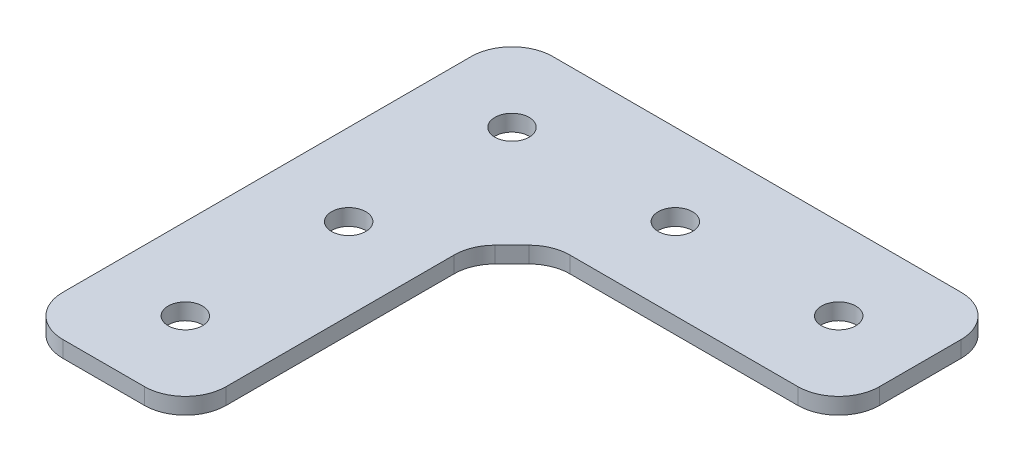
ISO-10303-21;
HEADER;
FILE_DESCRIPTION(('STEP AP214'),'2;1');
FILE_NAME('part.step','',(''),(''),'','','');
FILE_SCHEMA(('AUTOMOTIVE_DESIGN { 1 0 10303 214 1 1 1 1 }'));
ENDSEC;
DATA;
#1=APPLICATION_CONTEXT('core data for automotive mechanical design processes');
#2=APPLICATION_PROTOCOL_DEFINITION('international standard','automotive_design',2000,#1);
#3=PRODUCT_CONTEXT('',#1,'mechanical');
#4=PRODUCT('Part','Part','',(#3));
#5=PRODUCT_RELATED_PRODUCT_CATEGORY('part','',(#4));
#6=PRODUCT_DEFINITION_FORMATION('','',#4);
#7=PRODUCT_DEFINITION_CONTEXT('part definition',#1,'design');
#8=PRODUCT_DEFINITION('design','',#6,#7);
#9=PRODUCT_DEFINITION_SHAPE('','',#8);
#10=(LENGTH_UNIT() NAMED_UNIT(*) SI_UNIT(.MILLI.,.METRE.));
#11=(NAMED_UNIT(*) PLANE_ANGLE_UNIT() SI_UNIT($,.RADIAN.));
#12=(NAMED_UNIT(*) SI_UNIT($,.STERADIAN.) SOLID_ANGLE_UNIT());
#13=UNCERTAINTY_MEASURE_WITH_UNIT(LENGTH_MEASURE(1.E-05),#10,'distance_accuracy_value','');
#14=(GEOMETRIC_REPRESENTATION_CONTEXT(3) GLOBAL_UNCERTAINTY_ASSIGNED_CONTEXT((#13)) GLOBAL_UNIT_ASSIGNED_CONTEXT((#10,
#11,#12)) REPRESENTATION_CONTEXT('',''));
#15=CARTESIAN_POINT('',(0.,0.,0.));
#16=DIRECTION('',(0.,0.,1.));
#17=DIRECTION('',(1.,0.,0.));
#18=AXIS2_PLACEMENT_3D('',#15,#16,#17);
#19=CARTESIAN_POINT('',(10.0000000000002,-2.,10.));
#20=DIRECTION('',(1.,0.,0.));
#21=DIRECTION('',(0.,0.,-1.));
#22=AXIS2_PLACEMENT_3D('',#19,#20,#21);
#23=PLANE('',#22);
#24=DIRECTION('',(0.,0.,-1.));
#25=VECTOR('',#24,1.);
#26=CARTESIAN_POINT('',(10.0000000000002,-2.,10.));
#27=LINE('',#26,#25);
#28=CARTESIAN_POINT('',(10.0000000000002,-2.,45.));
#29=VERTEX_POINT('',#28);
#30=CARTESIAN_POINT('',(10.0000000000002,-2.,17.0710678118655));
#31=VERTEX_POINT('',#30);
#32=EDGE_CURVE('E262',#29,#31,#27,.T.);
#33=ORIENTED_EDGE('',*,*,#32,.T.);
#34=DIRECTION('',(0.,-1.,0.));
#35=VECTOR('',#34,1.);
#36=CARTESIAN_POINT('',(10.0000000000002,-2.,17.0710678118655));
#37=LINE('',#36,#35);
#38=CARTESIAN_POINT('',(10.0000000000002,0.,17.0710678118655));
#39=VERTEX_POINT('',#38);
#40=EDGE_CURVE('E216',#31,#39,#37,.F.);
#41=ORIENTED_EDGE('',*,*,#40,.T.);
#42=DIRECTION('',(0.,0.,-1.));
#43=VECTOR('',#42,1.);
#44=CARTESIAN_POINT('',(10.0000000000002,0.,10.));
#45=LINE('',#44,#43);
#46=CARTESIAN_POINT('',(10.0000000000002,0.,45.));
#47=VERTEX_POINT('',#46);
#48=EDGE_CURVE('E245',#47,#39,#45,.T.);
#49=ORIENTED_EDGE('',*,*,#48,.F.);
#50=DIRECTION('',(0.,1.,0.));
#51=VECTOR('',#50,1.);
#52=CARTESIAN_POINT('',(10.0000000000002,-2.,45.));
#53=LINE('',#52,#51);
#54=EDGE_CURVE('E197',#47,#29,#53,.F.);
#55=ORIENTED_EDGE('',*,*,#54,.T.);
#56=EDGE_LOOP('',(#33,#41,#49,#55));
#57=FACE_BOUND('',#56,.T.);
#58=ADVANCED_FACE('F43',(#57),#23,.T.);
#59=CARTESIAN_POINT('',(-9.99999999999979,-2.,50.));
#60=DIRECTION('',(0.,0.,1.));
#61=DIRECTION('',(1.,0.,0.));
#62=AXIS2_PLACEMENT_3D('',#59,#60,#61);
#63=PLANE('',#62);
#64=DIRECTION('',(1.,0.,0.));
#65=VECTOR('',#64,1.);
#66=CARTESIAN_POINT('',(-9.99999999999979,0.,50.));
#67=LINE('',#66,#65);
#68=CARTESIAN_POINT('',(-4.99999999999979,0.,50.));
#69=VERTEX_POINT('',#68);
#70=CARTESIAN_POINT('',(5.00000000000021,0.,50.));
#71=VERTEX_POINT('',#70);
#72=EDGE_CURVE('E162',#69,#71,#67,.T.);
#73=ORIENTED_EDGE('',*,*,#72,.F.);
#74=DIRECTION('',(0.,1.,0.));
#75=VECTOR('',#74,1.);
#76=CARTESIAN_POINT('',(-4.99999999999979,-2.,50.));
#77=LINE('',#76,#75);
#78=CARTESIAN_POINT('',(-4.99999999999979,-2.,50.));
#79=VERTEX_POINT('',#78);
#80=EDGE_CURVE('E185',#69,#79,#77,.F.);
#81=ORIENTED_EDGE('',*,*,#80,.T.);
#82=DIRECTION('',(1.,0.,0.));
#83=VECTOR('',#82,1.);
#84=CARTESIAN_POINT('',(-9.99999999999979,-2.,50.));
#85=LINE('',#84,#83);
#86=CARTESIAN_POINT('',(5.00000000000021,-2.,50.));
#87=VERTEX_POINT('',#86);
#88=EDGE_CURVE('E167',#79,#87,#85,.T.);
#89=ORIENTED_EDGE('',*,*,#88,.T.);
#90=DIRECTION('',(0.,1.,0.));
#91=VECTOR('',#90,1.);
#92=CARTESIAN_POINT('',(5.00000000000021,-2.,50.));
#93=LINE('',#92,#91);
#94=EDGE_CURVE('E182',#87,#71,#93,.T.);
#95=ORIENTED_EDGE('',*,*,#94,.T.);
#96=EDGE_LOOP('',(#73,#81,#89,#95));
#97=FACE_BOUND('',#96,.T.);
#98=ADVANCED_FACE('F330',(#97),#63,.T.);
#99=CARTESIAN_POINT('',(-9.9999999999998,-2.,-9.99999999999999));
#100=DIRECTION('',(-1.,0.,0.));
#101=DIRECTION('',(0.,0.,1.));
#102=AXIS2_PLACEMENT_3D('',#99,#100,#101);
#103=PLANE('',#102);
#104=DIRECTION('',(0.,0.,1.));
#105=VECTOR('',#104,1.);
#106=CARTESIAN_POINT('',(-9.9999999999998,-2.,-9.99999999999999));
#107=LINE('',#106,#105);
#108=CARTESIAN_POINT('',(-9.9999999999998,-2.,-4.99999999999999));
#109=VERTEX_POINT('',#108);
#110=CARTESIAN_POINT('',(-9.99999999999979,-2.,45.));
#111=VERTEX_POINT('',#110);
#112=EDGE_CURVE('E171',#109,#111,#107,.T.);
#113=ORIENTED_EDGE('',*,*,#112,.T.);
#114=DIRECTION('',(0.,1.,0.));
#115=VECTOR('',#114,1.);
#116=CARTESIAN_POINT('',(-9.99999999999979,-2.,45.));
#117=LINE('',#116,#115);
#118=CARTESIAN_POINT('',(-9.99999999999979,0.,45.));
#119=VERTEX_POINT('',#118);
#120=EDGE_CURVE('E153',#111,#119,#117,.T.);
#121=ORIENTED_EDGE('',*,*,#120,.T.);
#122=DIRECTION('',(0.,0.,1.));
#123=VECTOR('',#122,1.);
#124=CARTESIAN_POINT('',(-9.9999999999998,0.,-9.99999999999999));
#125=LINE('',#124,#123);
#126=CARTESIAN_POINT('',(-9.9999999999998,0.,-4.99999999999999));
#127=VERTEX_POINT('',#126);
#128=EDGE_CURVE('E145',#127,#119,#125,.T.);
#129=ORIENTED_EDGE('',*,*,#128,.F.);
#130=DIRECTION('',(0.,1.,0.));
#131=VECTOR('',#130,1.);
#132=CARTESIAN_POINT('',(-9.9999999999998,-2.,-4.99999999999999));
#133=LINE('',#132,#131);
#134=EDGE_CURVE('E159',#127,#109,#133,.F.);
#135=ORIENTED_EDGE('',*,*,#134,.T.);
#136=EDGE_LOOP('',(#113,#121,#129,#135));
#137=FACE_BOUND('',#136,.T.);
#138=ADVANCED_FACE('F158',(#137),#103,.T.);
#139=CARTESIAN_POINT('',(-9.9999999999998,-2.,-9.99999999999999));
#140=DIRECTION('',(0.,0.,-1.));
#141=DIRECTION('',(-1.,0.,0.));
#142=AXIS2_PLACEMENT_3D('',#139,#140,#141);
#143=PLANE('',#142);
#144=DIRECTION('',(-1.,0.,0.));
#145=VECTOR('',#144,1.);
#146=CARTESIAN_POINT('',(-9.9999999999998,0.,-9.99999999999999));
#147=LINE('',#146,#145);
#148=CARTESIAN_POINT('',(45.0000000000002,0.,-9.99999999999999));
#149=VERTEX_POINT('',#148);
#150=CARTESIAN_POINT('',(-4.9999999999998,0.,-9.99999999999999));
#151=VERTEX_POINT('',#150);
#152=EDGE_CURVE('E147',#149,#151,#147,.T.);
#153=ORIENTED_EDGE('',*,*,#152,.F.);
#154=DIRECTION('',(0.,1.,0.));
#155=VECTOR('',#154,1.);
#156=CARTESIAN_POINT('',(45.0000000000002,-2.,-9.99999999999999));
#157=LINE('',#156,#155);
#158=CARTESIAN_POINT('',(45.0000000000002,-2.,-9.99999999999999));
#159=VERTEX_POINT('',#158);
#160=EDGE_CURVE('E209',#149,#159,#157,.F.);
#161=ORIENTED_EDGE('',*,*,#160,.T.);
#162=DIRECTION('',(-1.,0.,0.));
#163=VECTOR('',#162,1.);
#164=CARTESIAN_POINT('',(-9.9999999999998,-2.,-9.99999999999999));
#165=LINE('',#164,#163);
#166=CARTESIAN_POINT('',(-4.9999999999998,-2.,-9.99999999999999));
#167=VERTEX_POINT('',#166);
#168=EDGE_CURVE('E255',#159,#167,#165,.T.);
#169=ORIENTED_EDGE('',*,*,#168,.T.);
#170=DIRECTION('',(0.,1.,0.));
#171=VECTOR('',#170,1.);
#172=CARTESIAN_POINT('',(-4.9999999999998,-2.,-9.99999999999999));
#173=LINE('',#172,#171);
#174=EDGE_CURVE('E207',#167,#151,#173,.T.);
#175=ORIENTED_EDGE('',*,*,#174,.T.);
#176=EDGE_LOOP('',(#153,#161,#169,#175));
#177=FACE_BOUND('',#176,.T.);
#178=ADVANCED_FACE('F381',(#177),#143,.T.);
#179=CARTESIAN_POINT('',(50.0000000000002,-2.,-9.99999999999999));
#180=DIRECTION('',(1.,0.,0.));
#181=DIRECTION('',(0.,0.,-1.));
#182=AXIS2_PLACEMENT_3D('',#179,#180,#181);
#183=PLANE('',#182);
#184=DIRECTION('',(0.,0.,-1.));
#185=VECTOR('',#184,1.);
#186=CARTESIAN_POINT('',(50.0000000000002,0.,-9.99999999999999));
#187=LINE('',#186,#185);
#188=CARTESIAN_POINT('',(50.0000000000002,0.,5.00000000000001));
#189=VERTEX_POINT('',#188);
#190=CARTESIAN_POINT('',(50.0000000000002,0.,-4.99999999999999));
#191=VERTEX_POINT('',#190);
#192=EDGE_CURVE('E244',#189,#191,#187,.T.);
#193=ORIENTED_EDGE('',*,*,#192,.F.);
#194=DIRECTION('',(0.,1.,0.));
#195=VECTOR('',#194,1.);
#196=CARTESIAN_POINT('',(50.0000000000002,-2.,5.00000000000001));
#197=LINE('',#196,#195);
#198=CARTESIAN_POINT('',(50.0000000000002,-2.,5.00000000000001));
#199=VERTEX_POINT('',#198);
#200=EDGE_CURVE('E205',#189,#199,#197,.F.);
#201=ORIENTED_EDGE('',*,*,#200,.T.);
#202=DIRECTION('',(0.,0.,-1.));
#203=VECTOR('',#202,1.);
#204=CARTESIAN_POINT('',(50.0000000000002,-2.,-9.99999999999999));
#205=LINE('',#204,#203);
#206=CARTESIAN_POINT('',(50.0000000000002,-2.,-4.99999999999999));
#207=VERTEX_POINT('',#206);
#208=EDGE_CURVE('E258',#199,#207,#205,.T.);
#209=ORIENTED_EDGE('',*,*,#208,.T.);
#210=DIRECTION('',(0.,1.,0.));
#211=VECTOR('',#210,1.);
#212=CARTESIAN_POINT('',(50.0000000000002,-2.,-4.99999999999999));
#213=LINE('',#212,#211);
#214=EDGE_CURVE('E202',#207,#191,#213,.T.);
#215=ORIENTED_EDGE('',*,*,#214,.T.);
#216=EDGE_LOOP('',(#193,#201,#209,#215));
#217=FACE_BOUND('',#216,.T.);
#218=ADVANCED_FACE('F388',(#217),#183,.T.);
#219=CARTESIAN_POINT('',(50.0000000000002,-2.,10.));
#220=DIRECTION('',(0.,0.,1.));
#221=DIRECTION('',(1.,0.,0.));
#222=AXIS2_PLACEMENT_3D('',#219,#220,#221);
#223=PLANE('',#222);
#224=DIRECTION('',(1.,0.,0.));
#225=VECTOR('',#224,1.);
#226=CARTESIAN_POINT('',(50.0000000000002,0.,10.));
#227=LINE('',#226,#225);
#228=CARTESIAN_POINT('',(17.0710678118657,0.,10.));
#229=VERTEX_POINT('',#228);
#230=CARTESIAN_POINT('',(45.0000000000002,0.,10.));
#231=VERTEX_POINT('',#230);
#232=EDGE_CURVE('E241',#229,#231,#227,.T.);
#233=ORIENTED_EDGE('',*,*,#232,.F.);
#234=DIRECTION('',(0.,1.,0.));
#235=VECTOR('',#234,1.);
#236=CARTESIAN_POINT('',(17.0710678118657,-2.,10.));
#237=LINE('',#236,#235);
#238=CARTESIAN_POINT('',(17.0710678118657,-2.,10.));
#239=VERTEX_POINT('',#238);
#240=EDGE_CURVE('E223',#229,#239,#237,.F.);
#241=ORIENTED_EDGE('',*,*,#240,.T.);
#242=DIRECTION('',(1.,0.,0.));
#243=VECTOR('',#242,1.);
#244=CARTESIAN_POINT('',(50.0000000000002,-2.,10.));
#245=LINE('',#244,#243);
#246=CARTESIAN_POINT('',(45.0000000000002,-2.,10.));
#247=VERTEX_POINT('',#246);
#248=EDGE_CURVE('E234',#239,#247,#245,.T.);
#249=ORIENTED_EDGE('',*,*,#248,.T.);
#250=DIRECTION('',(0.,1.,0.));
#251=VECTOR('',#250,1.);
#252=CARTESIAN_POINT('',(45.0000000000002,-2.,10.));
#253=LINE('',#252,#251);
#254=EDGE_CURVE('E199',#247,#231,#253,.T.);
#255=ORIENTED_EDGE('',*,*,#254,.T.);
#256=EDGE_LOOP('',(#233,#241,#249,#255));
#257=FACE_BOUND('',#256,.T.);
#258=ADVANCED_FACE('F240',(#257),#223,.T.);
#259=CARTESIAN_POINT('',(0.,-2.,0.));
#260=DIRECTION('',(0.,1.,0.));
#261=DIRECTION('',(0.,0.,1.));
#262=AXIS2_PLACEMENT_3D('',#259,#260,#261);
#263=PLANE('',#262);
#264=CARTESIAN_POINT('',(4.16528467062881E-13,-2.,40.));
#265=DIRECTION('',(0.,1.,0.));
#266=DIRECTION('',(0.,0.,1.));
#267=AXIS2_PLACEMENT_3D('',#264,#265,#266);
#268=CIRCLE('',#267,2.1);
#269=CARTESIAN_POINT('',(4.16528467062881E-13,-2.,42.1));
#270=VERTEX_POINT('',#269);
#271=EDGE_CURVE('E286',#270,#270,#268,.T.);
#272=ORIENTED_EDGE('',*,*,#271,.T.);
#273=EDGE_LOOP('',(#272));
#274=FACE_BOUND('',#273,.T.);
#275=CARTESIAN_POINT('',(2.08264233531441E-13,-2.,20.));
#276=DIRECTION('',(0.,1.,0.));
#277=DIRECTION('',(0.,0.,1.));
#278=AXIS2_PLACEMENT_3D('',#275,#276,#277);
#279=CIRCLE('',#278,2.1);
#280=CARTESIAN_POINT('',(2.08264233531441E-13,-2.,22.1));
#281=VERTEX_POINT('',#280);
#282=EDGE_CURVE('E280',#281,#281,#279,.T.);
#283=ORIENTED_EDGE('',*,*,#282,.T.);
#284=EDGE_LOOP('',(#283));
#285=FACE_BOUND('',#284,.T.);
#286=CARTESIAN_POINT('',(40.,-2.,0.));
#287=DIRECTION('',(0.,1.,0.));
#288=DIRECTION('',(0.,0.,1.));
#289=AXIS2_PLACEMENT_3D('',#286,#287,#288);
#290=CIRCLE('',#289,2.1);
#291=CARTESIAN_POINT('',(40.,-2.,2.1));
#292=VERTEX_POINT('',#291);
#293=EDGE_CURVE('E274',#292,#292,#290,.T.);
#294=ORIENTED_EDGE('',*,*,#293,.T.);
#295=EDGE_LOOP('',(#294));
#296=FACE_BOUND('',#295,.T.);
#297=CARTESIAN_POINT('',(20.,-2.,0.));
#298=DIRECTION('',(0.,1.,0.));
#299=DIRECTION('',(0.,0.,1.));
#300=AXIS2_PLACEMENT_3D('',#297,#298,#299);
#301=CIRCLE('',#300,2.1);
#302=CARTESIAN_POINT('',(20.,-2.,2.1));
#303=VERTEX_POINT('',#302);
#304=EDGE_CURVE('E268',#303,#303,#301,.T.);
#305=ORIENTED_EDGE('',*,*,#304,.T.);
#306=EDGE_LOOP('',(#305));
#307=FACE_BOUND('',#306,.T.);
#308=CARTESIAN_POINT('',(0.,-2.,0.));
#309=DIRECTION('',(0.,1.,0.));
#310=DIRECTION('',(0.,0.,1.));
#311=AXIS2_PLACEMENT_3D('',#308,#309,#310);
#312=CIRCLE('',#311,2.1);
#313=CARTESIAN_POINT('',(0.,-2.,2.1));
#314=VERTEX_POINT('',#313);
#315=EDGE_CURVE('E250',#314,#314,#312,.T.);
#316=ORIENTED_EDGE('',*,*,#315,.T.);
#317=EDGE_LOOP('',(#316));
#318=FACE_BOUND('',#317,.T.);
#319=ORIENTED_EDGE('',*,*,#88,.F.);
#320=CARTESIAN_POINT('',(-4.99999999999979,-2.,45.));
#321=DIRECTION('',(0.,1.,0.));
#322=DIRECTION('',(0.,0.,1.));
#323=AXIS2_PLACEMENT_3D('',#320,#321,#322);
#324=CIRCLE('',#323,5.);
#325=EDGE_CURVE('E195',#79,#111,#324,.F.);
#326=ORIENTED_EDGE('',*,*,#325,.T.);
#327=ORIENTED_EDGE('',*,*,#112,.F.);
#328=CARTESIAN_POINT('',(-4.9999999999998,-2.,-4.99999999999999));
#329=DIRECTION('',(0.,1.,0.));
#330=DIRECTION('',(0.,0.,1.));
#331=AXIS2_PLACEMENT_3D('',#328,#329,#330);
#332=CIRCLE('',#331,5.);
#333=EDGE_CURVE('E166',#109,#167,#332,.F.);
#334=ORIENTED_EDGE('',*,*,#333,.T.);
#335=ORIENTED_EDGE('',*,*,#168,.F.);
#336=CARTESIAN_POINT('',(45.0000000000002,-2.,-4.99999999999999));
#337=DIRECTION('',(0.,1.,0.));
#338=DIRECTION('',(0.,0.,1.));
#339=AXIS2_PLACEMENT_3D('',#336,#337,#338);
#340=CIRCLE('',#339,5.);
#341=EDGE_CURVE('E188',#159,#207,#340,.F.);
#342=ORIENTED_EDGE('',*,*,#341,.T.);
#343=ORIENTED_EDGE('',*,*,#208,.F.);
#344=CARTESIAN_POINT('',(45.0000000000002,-2.,5.00000000000001));
#345=DIRECTION('',(0.,1.,0.));
#346=DIRECTION('',(0.,0.,1.));
#347=AXIS2_PLACEMENT_3D('',#344,#345,#346);
#348=CIRCLE('',#347,5.);
#349=EDGE_CURVE('E190',#199,#247,#348,.F.);
#350=ORIENTED_EDGE('',*,*,#349,.T.);
#351=ORIENTED_EDGE('',*,*,#248,.F.);
#352=CARTESIAN_POINT('',(17.0710678118657,-2.,15.));
#353=DIRECTION('',(0.,1.,0.));
#354=DIRECTION('',(0.,0.,1.));
#355=AXIS2_PLACEMENT_3D('',#352,#353,#354);
#356=CIRCLE('',#355,5.);
#357=CARTESIAN_POINT('',(13.5355339059329,-2.,11.4644660940673));
#358=VERTEX_POINT('',#357);
#359=EDGE_CURVE('E51',#239,#358,#356,.T.);
#360=ORIENTED_EDGE('',*,*,#359,.T.);
#361=DIRECTION('',(0.707106781186544,0.,-0.707106781186551));
#362=VECTOR('',#361,1.);
#363=CARTESIAN_POINT('',(12.5000000000002,-2.,12.5000000000001));
#364=LINE('',#363,#362);
#365=CARTESIAN_POINT('',(11.4644660940674,-2.,13.5355339059328));
#366=VERTEX_POINT('',#365);
#367=EDGE_CURVE('E213',#358,#366,#364,.F.);
#368=ORIENTED_EDGE('',*,*,#367,.T.);
#369=CARTESIAN_POINT('',(15.0000000000002,-2.,17.0710678118655));
#370=DIRECTION('',(0.,1.,0.));
#371=DIRECTION('',(0.,0.,1.));
#372=AXIS2_PLACEMENT_3D('',#369,#370,#371);
#373=CIRCLE('',#372,5.);
#374=EDGE_CURVE('E227',#366,#31,#373,.T.);
#375=ORIENTED_EDGE('',*,*,#374,.T.);
#376=ORIENTED_EDGE('',*,*,#32,.F.);
#377=CARTESIAN_POINT('',(5.00000000000021,-2.,45.));
#378=DIRECTION('',(0.,1.,0.));
#379=DIRECTION('',(0.,0.,1.));
#380=AXIS2_PLACEMENT_3D('',#377,#378,#379);
#381=CIRCLE('',#380,5.);
#382=EDGE_CURVE('E193',#29,#87,#381,.F.);
#383=ORIENTED_EDGE('',*,*,#382,.T.);
#384=EDGE_LOOP('',(#319,#326,#327,#334,#335,#342,#343,#350,#351,#360,#368,#375,#376,#383));
#385=FACE_BOUND('',#384,.T.);
#386=ADVANCED_FACE('F232',(#274,#285,#296,#307,#318,#385),#263,.F.);
#387=CARTESIAN_POINT('',(0.,0.,0.));
#388=DIRECTION('',(0.,1.,0.));
#389=DIRECTION('',(0.,0.,1.));
#390=AXIS2_PLACEMENT_3D('',#387,#388,#389);
#391=PLANE('',#390);
#392=CARTESIAN_POINT('',(4.16528467062881E-13,0.,40.));
#393=DIRECTION('',(0.,1.,0.));
#394=DIRECTION('',(0.,0.,1.));
#395=AXIS2_PLACEMENT_3D('',#392,#393,#394);
#396=CIRCLE('',#395,2.1);
#397=CARTESIAN_POINT('',(4.16528467062881E-13,0.,42.1));
#398=VERTEX_POINT('',#397);
#399=EDGE_CURVE('E289',#398,#398,#396,.T.);
#400=ORIENTED_EDGE('',*,*,#399,.F.);
#401=EDGE_LOOP('',(#400));
#402=FACE_BOUND('',#401,.T.);
#403=CARTESIAN_POINT('',(2.08264233531441E-13,0.,20.));
#404=DIRECTION('',(0.,1.,0.));
#405=DIRECTION('',(0.,0.,1.));
#406=AXIS2_PLACEMENT_3D('',#403,#404,#405);
#407=CIRCLE('',#406,2.1);
#408=CARTESIAN_POINT('',(2.08264233531441E-13,0.,22.1));
#409=VERTEX_POINT('',#408);
#410=EDGE_CURVE('E283',#409,#409,#407,.T.);
#411=ORIENTED_EDGE('',*,*,#410,.F.);
#412=EDGE_LOOP('',(#411));
#413=FACE_BOUND('',#412,.T.);
#414=CARTESIAN_POINT('',(40.,0.,0.));
#415=DIRECTION('',(0.,1.,0.));
#416=DIRECTION('',(0.,0.,1.));
#417=AXIS2_PLACEMENT_3D('',#414,#415,#416);
#418=CIRCLE('',#417,2.1);
#419=CARTESIAN_POINT('',(40.,0.,2.1));
#420=VERTEX_POINT('',#419);
#421=EDGE_CURVE('E277',#420,#420,#418,.T.);
#422=ORIENTED_EDGE('',*,*,#421,.F.);
#423=EDGE_LOOP('',(#422));
#424=FACE_BOUND('',#423,.T.);
#425=CARTESIAN_POINT('',(20.,0.,0.));
#426=DIRECTION('',(0.,1.,0.));
#427=DIRECTION('',(0.,0.,1.));
#428=AXIS2_PLACEMENT_3D('',#425,#426,#427);
#429=CIRCLE('',#428,2.1);
#430=CARTESIAN_POINT('',(20.,0.,2.1));
#431=VERTEX_POINT('',#430);
#432=EDGE_CURVE('E271',#431,#431,#429,.T.);
#433=ORIENTED_EDGE('',*,*,#432,.F.);
#434=EDGE_LOOP('',(#433));
#435=FACE_BOUND('',#434,.T.);
#436=CARTESIAN_POINT('',(0.,0.,0.));
#437=DIRECTION('',(0.,1.,0.));
#438=DIRECTION('',(0.,0.,1.));
#439=AXIS2_PLACEMENT_3D('',#436,#437,#438);
#440=CIRCLE('',#439,2.1);
#441=CARTESIAN_POINT('',(0.,0.,2.1));
#442=VERTEX_POINT('',#441);
#443=EDGE_CURVE('E265',#442,#442,#440,.T.);
#444=ORIENTED_EDGE('',*,*,#443,.F.);
#445=EDGE_LOOP('',(#444));
#446=FACE_BOUND('',#445,.T.);
#447=ORIENTED_EDGE('',*,*,#128,.T.);
#448=CARTESIAN_POINT('',(-4.99999999999979,0.,45.));
#449=DIRECTION('',(0.,1.,0.));
#450=DIRECTION('',(0.,0.,1.));
#451=AXIS2_PLACEMENT_3D('',#448,#449,#450);
#452=CIRCLE('',#451,5.);
#453=EDGE_CURVE('E180',#119,#69,#452,.T.);
#454=ORIENTED_EDGE('',*,*,#453,.T.);
#455=ORIENTED_EDGE('',*,*,#72,.T.);
#456=CARTESIAN_POINT('',(5.00000000000021,0.,45.));
#457=DIRECTION('',(0.,1.,0.));
#458=DIRECTION('',(0.,0.,1.));
#459=AXIS2_PLACEMENT_3D('',#456,#457,#458);
#460=CIRCLE('',#459,5.);
#461=EDGE_CURVE('E178',#71,#47,#460,.T.);
#462=ORIENTED_EDGE('',*,*,#461,.T.);
#463=ORIENTED_EDGE('',*,*,#48,.T.);
#464=CARTESIAN_POINT('',(15.0000000000002,0.,17.0710678118655));
#465=DIRECTION('',(0.,1.,0.));
#466=DIRECTION('',(0.,0.,1.));
#467=AXIS2_PLACEMENT_3D('',#464,#465,#466);
#468=CIRCLE('',#467,5.);
#469=CARTESIAN_POINT('',(11.4644660940674,0.,13.5355339059328));
#470=VERTEX_POINT('',#469);
#471=EDGE_CURVE('E225',#39,#470,#468,.F.);
#472=ORIENTED_EDGE('',*,*,#471,.T.);
#473=DIRECTION('',(-0.707106781186544,0.,0.707106781186551));
#474=VECTOR('',#473,1.);
#475=CARTESIAN_POINT('',(10.0000000000002,0.,15.));
#476=LINE('',#475,#474);
#477=CARTESIAN_POINT('',(13.5355339059329,0.,11.4644660940673));
#478=VERTEX_POINT('',#477);
#479=EDGE_CURVE('E211',#470,#478,#476,.F.);
#480=ORIENTED_EDGE('',*,*,#479,.T.);
#481=CARTESIAN_POINT('',(17.0710678118657,0.,15.));
#482=DIRECTION('',(0.,1.,0.));
#483=DIRECTION('',(0.,0.,1.));
#484=AXIS2_PLACEMENT_3D('',#481,#482,#483);
#485=CIRCLE('',#484,5.);
#486=EDGE_CURVE('E11',#478,#229,#485,.F.);
#487=ORIENTED_EDGE('',*,*,#486,.T.);
#488=ORIENTED_EDGE('',*,*,#232,.T.);
#489=CARTESIAN_POINT('',(45.0000000000002,0.,5.00000000000001));
#490=DIRECTION('',(0.,1.,0.));
#491=DIRECTION('',(0.,0.,1.));
#492=AXIS2_PLACEMENT_3D('',#489,#490,#491);
#493=CIRCLE('',#492,5.);
#494=EDGE_CURVE('E176',#231,#189,#493,.T.);
#495=ORIENTED_EDGE('',*,*,#494,.T.);
#496=ORIENTED_EDGE('',*,*,#192,.T.);
#497=CARTESIAN_POINT('',(45.0000000000002,0.,-4.99999999999999));
#498=DIRECTION('',(0.,1.,0.));
#499=DIRECTION('',(0.,0.,1.));
#500=AXIS2_PLACEMENT_3D('',#497,#498,#499);
#501=CIRCLE('',#500,5.);
#502=EDGE_CURVE('E152',#191,#149,#501,.T.);
#503=ORIENTED_EDGE('',*,*,#502,.T.);
#504=ORIENTED_EDGE('',*,*,#152,.T.);
#505=CARTESIAN_POINT('',(-4.9999999999998,0.,-4.99999999999999));
#506=DIRECTION('',(0.,1.,0.));
#507=DIRECTION('',(0.,0.,1.));
#508=AXIS2_PLACEMENT_3D('',#505,#506,#507);
#509=CIRCLE('',#508,5.);
#510=EDGE_CURVE('E142',#151,#127,#509,.T.);
#511=ORIENTED_EDGE('',*,*,#510,.T.);
#512=EDGE_LOOP('',(#447,#454,#455,#462,#463,#472,#480,#487,#488,#495,#496,#503,#504,#511));
#513=FACE_BOUND('',#512,.T.);
#514=ADVANCED_FACE('F144',(#402,#413,#424,#435,#446,#513),#391,.T.);
#515=CARTESIAN_POINT('',(0.,-2.,0.));
#516=DIRECTION('',(0.,1.,0.));
#517=DIRECTION('',(0.,0.,1.));
#518=AXIS2_PLACEMENT_3D('',#515,#516,#517);
#519=CYLINDRICAL_SURFACE('',#518,2.1);
#520=ORIENTED_EDGE('',*,*,#315,.F.);
#521=EDGE_LOOP('',(#520));
#522=FACE_BOUND('',#521,.T.);
#523=ORIENTED_EDGE('',*,*,#443,.T.);
#524=EDGE_LOOP('',(#523));
#525=FACE_BOUND('',#524,.T.);
#526=ADVANCED_FACE('F307',(#522,#525),#519,.F.);
#527=CARTESIAN_POINT('',(20.,-2.,0.));
#528=DIRECTION('',(0.,1.,0.));
#529=DIRECTION('',(0.,0.,1.));
#530=AXIS2_PLACEMENT_3D('',#527,#528,#529);
#531=CYLINDRICAL_SURFACE('',#530,2.1);
#532=ORIENTED_EDGE('',*,*,#304,.F.);
#533=EDGE_LOOP('',(#532));
#534=FACE_BOUND('',#533,.T.);
#535=ORIENTED_EDGE('',*,*,#432,.T.);
#536=EDGE_LOOP('',(#535));
#537=FACE_BOUND('',#536,.T.);
#538=ADVANCED_FACE('F318',(#534,#537),#531,.F.);
#539=CARTESIAN_POINT('',(40.,-2.,0.));
#540=DIRECTION('',(0.,1.,0.));
#541=DIRECTION('',(0.,0.,1.));
#542=AXIS2_PLACEMENT_3D('',#539,#540,#541);
#543=CYLINDRICAL_SURFACE('',#542,2.1);
#544=ORIENTED_EDGE('',*,*,#293,.F.);
#545=EDGE_LOOP('',(#544));
#546=FACE_BOUND('',#545,.T.);
#547=ORIENTED_EDGE('',*,*,#421,.T.);
#548=EDGE_LOOP('',(#547));
#549=FACE_BOUND('',#548,.T.);
#550=ADVANCED_FACE('F324',(#546,#549),#543,.F.);
#551=CARTESIAN_POINT('',(2.08264233531441E-13,-2.,20.));
#552=DIRECTION('',(0.,1.,0.));
#553=DIRECTION('',(0.,0.,1.));
#554=AXIS2_PLACEMENT_3D('',#551,#552,#553);
#555=CYLINDRICAL_SURFACE('',#554,2.1);
#556=ORIENTED_EDGE('',*,*,#282,.F.);
#557=EDGE_LOOP('',(#556));
#558=FACE_BOUND('',#557,.T.);
#559=ORIENTED_EDGE('',*,*,#410,.T.);
#560=EDGE_LOOP('',(#559));
#561=FACE_BOUND('',#560,.T.);
#562=ADVANCED_FACE('F301',(#558,#561),#555,.F.);
#563=CARTESIAN_POINT('',(4.16528467062881E-13,-2.,40.));
#564=DIRECTION('',(0.,1.,0.));
#565=DIRECTION('',(0.,0.,1.));
#566=AXIS2_PLACEMENT_3D('',#563,#564,#565);
#567=CYLINDRICAL_SURFACE('',#566,2.1);
#568=ORIENTED_EDGE('',*,*,#271,.F.);
#569=EDGE_LOOP('',(#568));
#570=FACE_BOUND('',#569,.T.);
#571=ORIENTED_EDGE('',*,*,#399,.T.);
#572=EDGE_LOOP('',(#571));
#573=FACE_BOUND('',#572,.T.);
#574=ADVANCED_FACE('F297',(#570,#573),#567,.F.);
#575=CARTESIAN_POINT('',(-4.99999999999979,-2.,45.));
#576=DIRECTION('',(0.,1.,0.));
#577=DIRECTION('',(0.,0.,1.));
#578=AXIS2_PLACEMENT_3D('',#575,#576,#577);
#579=CYLINDRICAL_SURFACE('',#578,5.);
#580=ORIENTED_EDGE('',*,*,#325,.F.);
#581=ORIENTED_EDGE('',*,*,#80,.F.);
#582=ORIENTED_EDGE('',*,*,#453,.F.);
#583=ORIENTED_EDGE('',*,*,#120,.F.);
#584=EDGE_LOOP('',(#580,#581,#582,#583));
#585=FACE_BOUND('',#584,.T.);
#586=ADVANCED_FACE('F300',(#585),#579,.T.);
#587=CARTESIAN_POINT('',(5.00000000000021,-2.,45.));
#588=DIRECTION('',(0.,1.,0.));
#589=DIRECTION('',(0.,0.,1.));
#590=AXIS2_PLACEMENT_3D('',#587,#588,#589);
#591=CYLINDRICAL_SURFACE('',#590,5.);
#592=ORIENTED_EDGE('',*,*,#382,.F.);
#593=ORIENTED_EDGE('',*,*,#54,.F.);
#594=ORIENTED_EDGE('',*,*,#461,.F.);
#595=ORIENTED_EDGE('',*,*,#94,.F.);
#596=EDGE_LOOP('',(#592,#593,#594,#595));
#597=FACE_BOUND('',#596,.T.);
#598=ADVANCED_FACE('F343',(#597),#591,.T.);
#599=CARTESIAN_POINT('',(45.0000000000002,-2.,5.00000000000001));
#600=DIRECTION('',(0.,1.,0.));
#601=DIRECTION('',(0.,0.,1.));
#602=AXIS2_PLACEMENT_3D('',#599,#600,#601);
#603=CYLINDRICAL_SURFACE('',#602,5.);
#604=ORIENTED_EDGE('',*,*,#349,.F.);
#605=ORIENTED_EDGE('',*,*,#200,.F.);
#606=ORIENTED_EDGE('',*,*,#494,.F.);
#607=ORIENTED_EDGE('',*,*,#254,.F.);
#608=EDGE_LOOP('',(#604,#605,#606,#607));
#609=FACE_BOUND('',#608,.T.);
#610=ADVANCED_FACE('F347',(#609),#603,.T.);
#611=CARTESIAN_POINT('',(45.0000000000002,-2.,-4.99999999999999));
#612=DIRECTION('',(0.,1.,0.));
#613=DIRECTION('',(0.,0.,1.));
#614=AXIS2_PLACEMENT_3D('',#611,#612,#613);
#615=CYLINDRICAL_SURFACE('',#614,5.);
#616=ORIENTED_EDGE('',*,*,#341,.F.);
#617=ORIENTED_EDGE('',*,*,#160,.F.);
#618=ORIENTED_EDGE('',*,*,#502,.F.);
#619=ORIENTED_EDGE('',*,*,#214,.F.);
#620=EDGE_LOOP('',(#616,#617,#618,#619));
#621=FACE_BOUND('',#620,.T.);
#622=ADVANCED_FACE('F351',(#621),#615,.T.);
#623=CARTESIAN_POINT('',(-4.9999999999998,-2.,-4.99999999999999));
#624=DIRECTION('',(0.,1.,0.));
#625=DIRECTION('',(0.,0.,1.));
#626=AXIS2_PLACEMENT_3D('',#623,#624,#625);
#627=CYLINDRICAL_SURFACE('',#626,5.);
#628=ORIENTED_EDGE('',*,*,#333,.F.);
#629=ORIENTED_EDGE('',*,*,#134,.F.);
#630=ORIENTED_EDGE('',*,*,#510,.F.);
#631=ORIENTED_EDGE('',*,*,#174,.F.);
#632=EDGE_LOOP('',(#628,#629,#630,#631));
#633=FACE_BOUND('',#632,.T.);
#634=ADVANCED_FACE('F165',(#633),#627,.T.);
#635=CARTESIAN_POINT('',(10.0000000000002,-2.,15.));
#636=DIRECTION('',(0.707106781186551,0.,0.707106781186544));
#637=DIRECTION('',(0.,-1.,0.));
#638=AXIS2_PLACEMENT_3D('',#635,#636,#637);
#639=PLANE('',#638);
#640=ORIENTED_EDGE('',*,*,#479,.F.);
#641=DIRECTION('',(0.,1.,0.));
#642=VECTOR('',#641,1.);
#643=CARTESIAN_POINT('',(11.4644660940674,-2.,13.5355339059328));
#644=LINE('',#643,#642);
#645=EDGE_CURVE('E221',#470,#366,#644,.F.);
#646=ORIENTED_EDGE('',*,*,#645,.T.);
#647=ORIENTED_EDGE('',*,*,#367,.F.);
#648=DIRECTION('',(0.,-1.,0.));
#649=VECTOR('',#648,1.);
#650=CARTESIAN_POINT('',(13.5355339059329,-2.,11.4644660940673));
#651=LINE('',#650,#649);
#652=EDGE_CURVE('E219',#358,#478,#651,.F.);
#653=ORIENTED_EDGE('',*,*,#652,.T.);
#654=EDGE_LOOP('',(#640,#646,#647,#653));
#655=FACE_BOUND('',#654,.T.);
#656=ADVANCED_FACE('F237',(#655),#639,.T.);
#657=CARTESIAN_POINT('',(15.0000000000002,-2.,17.0710678118655));
#658=DIRECTION('',(0.,-1.,0.));
#659=DIRECTION('',(0.,0.,-1.));
#660=AXIS2_PLACEMENT_3D('',#657,#658,#659);
#661=CYLINDRICAL_SURFACE('',#660,5.);
#662=ORIENTED_EDGE('',*,*,#374,.F.);
#663=ORIENTED_EDGE('',*,*,#645,.F.);
#664=ORIENTED_EDGE('',*,*,#471,.F.);
#665=ORIENTED_EDGE('',*,*,#40,.F.);
#666=EDGE_LOOP('',(#662,#663,#664,#665));
#667=FACE_BOUND('',#666,.T.);
#668=ADVANCED_FACE('F362',(#667),#661,.F.);
#669=CARTESIAN_POINT('',(17.0710678118657,-2.,15.));
#670=DIRECTION('',(0.,1.,0.));
#671=DIRECTION('',(0.,0.,1.));
#672=AXIS2_PLACEMENT_3D('',#669,#670,#671);
#673=CYLINDRICAL_SURFACE('',#672,5.);
#674=ORIENTED_EDGE('',*,*,#486,.F.);
#675=ORIENTED_EDGE('',*,*,#652,.F.);
#676=ORIENTED_EDGE('',*,*,#359,.F.);
#677=ORIENTED_EDGE('',*,*,#240,.F.);
#678=EDGE_LOOP('',(#674,#675,#676,#677));
#679=FACE_BOUND('',#678,.T.);
#680=ADVANCED_FACE('F45',(#679),#673,.F.);
#681=CLOSED_SHELL('',(#58,#98,#138,#178,#218,#258,#386,#514,#526,#538,#550,#562,#574,#586,#598,
#610,#622,#634,#656,#668,#680));
#682=MANIFOLD_SOLID_BREP('B2',#681);
#683=ADVANCED_BREP_SHAPE_REPRESENTATION('',(#18,#682),#14);
#684=SHAPE_DEFINITION_REPRESENTATION(#9,#683);
ENDSEC;
END-ISO-10303-21;
